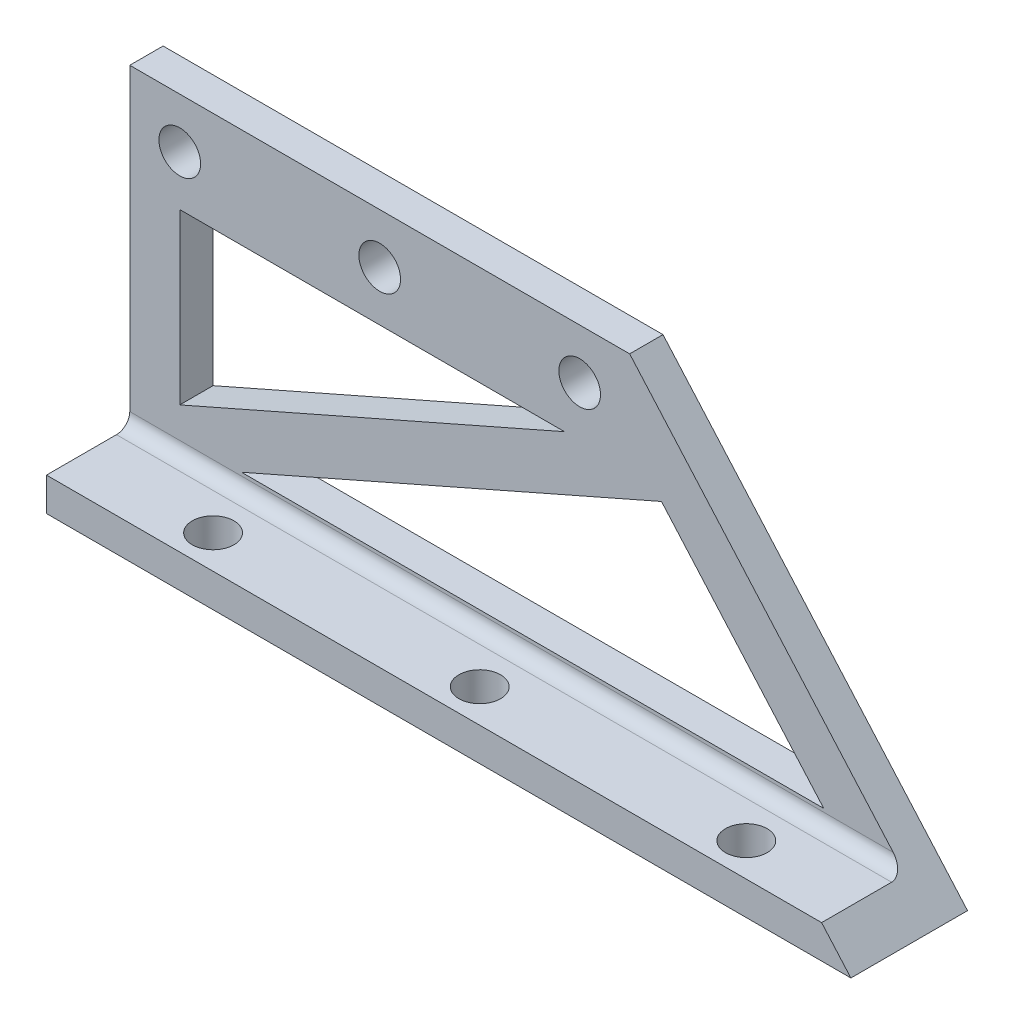
ISO-10303-21;
HEADER;
FILE_DESCRIPTION(('STEP AP214'),'2;1');
FILE_NAME('part.step','',(''),(''),'','','');
FILE_SCHEMA(('AUTOMOTIVE_DESIGN { 1 0 10303 214 1 1 1 1 }'));
ENDSEC;
DATA;
#1=APPLICATION_CONTEXT('core data for automotive mechanical design processes');
#2=APPLICATION_PROTOCOL_DEFINITION('international standard','automotive_design',2000,#1);
#3=PRODUCT_CONTEXT('',#1,'mechanical');
#4=PRODUCT('Part','Part','',(#3));
#5=PRODUCT_RELATED_PRODUCT_CATEGORY('part','',(#4));
#6=PRODUCT_DEFINITION_FORMATION('','',#4);
#7=PRODUCT_DEFINITION_CONTEXT('part definition',#1,'design');
#8=PRODUCT_DEFINITION('design','',#6,#7);
#9=PRODUCT_DEFINITION_SHAPE('','',#8);
#10=(LENGTH_UNIT() NAMED_UNIT(*) SI_UNIT(.MILLI.,.METRE.));
#11=(NAMED_UNIT(*) PLANE_ANGLE_UNIT() SI_UNIT($,.RADIAN.));
#12=(NAMED_UNIT(*) SI_UNIT($,.STERADIAN.) SOLID_ANGLE_UNIT());
#13=UNCERTAINTY_MEASURE_WITH_UNIT(LENGTH_MEASURE(1.E-05),#10,'distance_accuracy_value','');
#14=(GEOMETRIC_REPRESENTATION_CONTEXT(3) GLOBAL_UNCERTAINTY_ASSIGNED_CONTEXT((#13)) GLOBAL_UNIT_ASSIGNED_CONTEXT((#10,
#11,#12)) REPRESENTATION_CONTEXT('',''));
#15=CARTESIAN_POINT('',(0.,0.,0.));
#16=DIRECTION('',(0.,0.,1.));
#17=DIRECTION('',(1.,0.,0.));
#18=AXIS2_PLACEMENT_3D('',#15,#16,#17);
#19=CARTESIAN_POINT('',(0.,0.,6.35));
#20=DIRECTION('',(0.,0.,-1.));
#21=DIRECTION('',(-1.,0.,0.));
#22=AXIS2_PLACEMENT_3D('',#19,#20,#21);
#23=PLANE('',#22);
#24=DIRECTION('',(0.91541039740455,0.402521806022535,0.));
#25=VECTOR('',#24,1.);
#26=CARTESIAN_POINT('',(82.8299693463469,46.99,6.35));
#27=LINE('',#26,#25);
#28=CARTESIAN_POINT('',(9.52500000000001,14.7565353863377,6.35));
#29=VERTEX_POINT('',#28);
#30=CARTESIAN_POINT('',(82.8299693463469,46.99,6.35));
#31=VERTEX_POINT('',#30);
#32=EDGE_CURVE('E188',#29,#31,#27,.T.);
#33=ORIENTED_EDGE('',*,*,#32,.F.);
#34=DIRECTION('',(0.,-1.,0.));
#35=VECTOR('',#34,1.);
#36=CARTESIAN_POINT('',(9.52500000000001,14.7565353863377,6.35));
#37=LINE('',#36,#35);
#38=CARTESIAN_POINT('',(9.525,46.99,6.35));
#39=VERTEX_POINT('',#38);
#40=EDGE_CURVE('E194',#39,#29,#37,.T.);
#41=ORIENTED_EDGE('',*,*,#40,.F.);
#42=DIRECTION('',(-1.,0.,0.));
#43=VECTOR('',#42,1.);
#44=CARTESIAN_POINT('',(9.525,46.99,6.35));
#45=LINE('',#44,#43);
#46=EDGE_CURVE('E190',#31,#39,#45,.T.);
#47=ORIENTED_EDGE('',*,*,#46,.F.);
#48=EDGE_LOOP('',(#33,#41,#47));
#49=FACE_BOUND('',#48,.T.);
#50=CARTESIAN_POINT('',(47.625,56.515,6.35));
#51=DIRECTION('',(0.,0.,1.));
#52=DIRECTION('',(1.,0.,0.));
#53=AXIS2_PLACEMENT_3D('',#50,#51,#52);
#54=CIRCLE('',#53,3.96875);
#55=CARTESIAN_POINT('',(51.59375,56.515,6.35));
#56=VERTEX_POINT('',#55);
#57=EDGE_CURVE('E218',#56,#56,#54,.T.);
#58=ORIENTED_EDGE('',*,*,#57,.F.);
#59=EDGE_LOOP('',(#58));
#60=FACE_BOUND('',#59,.T.);
#61=DIRECTION('',(0.,-1.,0.));
#62=VECTOR('',#61,1.);
#63=CARTESIAN_POINT('',(0.,0.,6.35));
#64=LINE('',#63,#62);
#65=CARTESIAN_POINT('',(0.,66.04,6.35));
#66=VERTEX_POINT('',#65);
#67=CARTESIAN_POINT('',(0.,8.89,6.35));
#68=VERTEX_POINT('',#67);
#69=EDGE_CURVE('E234',#66,#68,#64,.T.);
#70=ORIENTED_EDGE('',*,*,#69,.T.);
#71=DIRECTION('',(1.,0.,0.));
#72=VECTOR('',#71,1.);
#73=CARTESIAN_POINT('',(0.,8.89,6.35));
#74=LINE('',#73,#72);
#75=CARTESIAN_POINT('',(145.465778034099,8.89000000000003,6.35));
#76=VERTEX_POINT('',#75);
#77=EDGE_CURVE('E138',#68,#76,#74,.T.);
#78=ORIENTED_EDGE('',*,*,#77,.T.);
#79=DIRECTION('',(-0.660063065152084,0.751210190307637,0.));
#80=VECTOR('',#79,1.);
#81=CARTESIAN_POINT('',(95.25,66.04,6.35));
#82=LINE('',#81,#80);
#83=CARTESIAN_POINT('',(95.25,66.04,6.35));
#84=VERTEX_POINT('',#83);
#85=EDGE_CURVE('E229',#76,#84,#82,.T.);
#86=ORIENTED_EDGE('',*,*,#85,.T.);
#87=DIRECTION('',(-1.,0.,0.));
#88=VECTOR('',#87,1.);
#89=CARTESIAN_POINT('',(0.,66.04,6.35));
#90=LINE('',#89,#88);
#91=EDGE_CURVE('E231',#84,#66,#90,.T.);
#92=ORIENTED_EDGE('',*,*,#91,.T.);
#93=EDGE_LOOP('',(#70,#78,#86,#92));
#94=FACE_BOUND('',#93,.T.);
#95=CARTESIAN_POINT('',(9.52500000000001,56.515,6.35));
#96=DIRECTION('',(0.,0.,1.));
#97=DIRECTION('',(1.,0.,0.));
#98=AXIS2_PLACEMENT_3D('',#95,#96,#97);
#99=CIRCLE('',#98,3.96875000000001);
#100=CARTESIAN_POINT('',(13.49375,56.515,6.35));
#101=VERTEX_POINT('',#100);
#102=EDGE_CURVE('E224',#101,#101,#99,.T.);
#103=ORIENTED_EDGE('',*,*,#102,.F.);
#104=EDGE_LOOP('',(#103));
#105=FACE_BOUND('',#104,.T.);
#106=CARTESIAN_POINT('',(85.725,56.515,6.35));
#107=DIRECTION('',(0.,0.,1.));
#108=DIRECTION('',(1.,0.,0.));
#109=AXIS2_PLACEMENT_3D('',#106,#107,#108);
#110=CIRCLE('',#109,3.96875000000001);
#111=CARTESIAN_POINT('',(89.69375,56.515,6.35));
#112=VERTEX_POINT('',#111);
#113=EDGE_CURVE('E212',#112,#112,#110,.T.);
#114=ORIENTED_EDGE('',*,*,#113,.F.);
#115=EDGE_LOOP('',(#114));
#116=FACE_BOUND('',#115,.T.);
#117=DIRECTION('',(1.,0.,0.));
#118=VECTOR('',#117,1.);
#119=CARTESIAN_POINT('',(132.228284487454,9.525,6.35));
#120=LINE('',#119,#118);
#121=CARTESIAN_POINT('',(21.2908175087575,9.52499999999998,6.35));
#122=VERTEX_POINT('',#121);
#123=CARTESIAN_POINT('',(132.228284487454,9.525,6.35));
#124=VERTEX_POINT('',#123);
#125=EDGE_CURVE('E164',#122,#124,#120,.T.);
#126=ORIENTED_EDGE('',*,*,#125,.F.);
#127=DIRECTION('',(-0.91541039740455,-0.402521806022535,0.));
#128=VECTOR('',#127,1.);
#129=CARTESIAN_POINT('',(21.2908175087575,9.52499999999998,6.35));
#130=LINE('',#129,#128);
#131=CARTESIAN_POINT('',(101.311219354226,44.7113565902367,6.35));
#132=VERTEX_POINT('',#131);
#133=EDGE_CURVE('E170',#132,#122,#130,.T.);
#134=ORIENTED_EDGE('',*,*,#133,.F.);
#135=DIRECTION('',(-0.660063065152084,0.751210190307637,0.));
#136=VECTOR('',#135,1.);
#137=CARTESIAN_POINT('',(101.311219354226,44.7113565902367,6.35));
#138=LINE('',#137,#136);
#139=EDGE_CURVE('E166',#124,#132,#138,.T.);
#140=ORIENTED_EDGE('',*,*,#139,.F.);
#141=EDGE_LOOP('',(#126,#134,#140));
#142=FACE_BOUND('',#141,.T.);
#143=ADVANCED_FACE('F33',(#49,#60,#94,#105,#116,#142),#23,.F.);
#144=CARTESIAN_POINT('',(0.,0.,0.));
#145=DIRECTION('',(0.,0.,-1.));
#146=DIRECTION('',(-1.,0.,0.));
#147=AXIS2_PLACEMENT_3D('',#144,#145,#146);
#148=PLANE('',#147);
#149=DIRECTION('',(0.,-1.,0.));
#150=VECTOR('',#149,1.);
#151=CARTESIAN_POINT('',(9.52500000000001,14.7565353863377,0.));
#152=LINE('',#151,#150);
#153=CARTESIAN_POINT('',(9.525,46.99,0.));
#154=VERTEX_POINT('',#153);
#155=CARTESIAN_POINT('',(9.52500000000001,14.7565353863377,0.));
#156=VERTEX_POINT('',#155);
#157=EDGE_CURVE('E191',#154,#156,#152,.T.);
#158=ORIENTED_EDGE('',*,*,#157,.T.);
#159=DIRECTION('',(0.91541039740455,0.402521806022535,0.));
#160=VECTOR('',#159,1.);
#161=CARTESIAN_POINT('',(82.8299693463469,46.99,0.));
#162=LINE('',#161,#160);
#163=CARTESIAN_POINT('',(82.8299693463469,46.99,0.));
#164=VERTEX_POINT('',#163);
#165=EDGE_CURVE('E187',#156,#164,#162,.T.);
#166=ORIENTED_EDGE('',*,*,#165,.T.);
#167=DIRECTION('',(-1.,0.,0.));
#168=VECTOR('',#167,1.);
#169=CARTESIAN_POINT('',(9.525,46.99,0.));
#170=LINE('',#169,#168);
#171=EDGE_CURVE('E199',#164,#154,#170,.T.);
#172=ORIENTED_EDGE('',*,*,#171,.T.);
#173=EDGE_LOOP('',(#158,#166,#172));
#174=FACE_BOUND('',#173,.T.);
#175=CARTESIAN_POINT('',(47.625,56.515,0.));
#176=DIRECTION('',(0.,0.,1.));
#177=DIRECTION('',(1.,0.,0.));
#178=AXIS2_PLACEMENT_3D('',#175,#176,#177);
#179=CIRCLE('',#178,3.96875);
#180=CARTESIAN_POINT('',(51.59375,56.515,0.));
#181=VERTEX_POINT('',#180);
#182=EDGE_CURVE('E215',#181,#181,#179,.T.);
#183=ORIENTED_EDGE('',*,*,#182,.T.);
#184=EDGE_LOOP('',(#183));
#185=FACE_BOUND('',#184,.T.);
#186=DIRECTION('',(1.,0.,0.));
#187=VECTOR('',#186,1.);
#188=CARTESIAN_POINT('',(153.277121283848,0.,0.));
#189=LINE('',#188,#187);
#190=CARTESIAN_POINT('',(0.,0.,0.));
#191=VERTEX_POINT('',#190);
#192=CARTESIAN_POINT('',(153.277121283848,0.,0.));
#193=VERTEX_POINT('',#192);
#194=EDGE_CURVE('E136',#191,#193,#189,.T.);
#195=ORIENTED_EDGE('',*,*,#194,.F.);
#196=DIRECTION('',(0.,-1.,0.));
#197=VECTOR('',#196,1.);
#198=CARTESIAN_POINT('',(0.,0.,0.));
#199=LINE('',#198,#197);
#200=CARTESIAN_POINT('',(0.,66.04,0.));
#201=VERTEX_POINT('',#200);
#202=EDGE_CURVE('E232',#201,#191,#199,.T.);
#203=ORIENTED_EDGE('',*,*,#202,.F.);
#204=DIRECTION('',(-1.,0.,0.));
#205=VECTOR('',#204,1.);
#206=CARTESIAN_POINT('',(0.,66.04,0.));
#207=LINE('',#206,#205);
#208=CARTESIAN_POINT('',(95.25,66.04,0.));
#209=VERTEX_POINT('',#208);
#210=EDGE_CURVE('E264',#209,#201,#207,.T.);
#211=ORIENTED_EDGE('',*,*,#210,.F.);
#212=DIRECTION('',(-0.660063065152084,0.751210190307637,0.));
#213=VECTOR('',#212,1.);
#214=CARTESIAN_POINT('',(95.25,66.04,0.));
#215=LINE('',#214,#213);
#216=EDGE_CURVE('E270',#193,#209,#215,.T.);
#217=ORIENTED_EDGE('',*,*,#216,.F.);
#218=EDGE_LOOP('',(#195,#203,#211,#217));
#219=FACE_BOUND('',#218,.T.);
#220=CARTESIAN_POINT('',(9.52500000000001,56.515,0.));
#221=DIRECTION('',(0.,0.,1.));
#222=DIRECTION('',(1.,0.,0.));
#223=AXIS2_PLACEMENT_3D('',#220,#221,#222);
#224=CIRCLE('',#223,3.96875000000001);
#225=CARTESIAN_POINT('',(13.49375,56.515,0.));
#226=VERTEX_POINT('',#225);
#227=EDGE_CURVE('E221',#226,#226,#224,.T.);
#228=ORIENTED_EDGE('',*,*,#227,.T.);
#229=EDGE_LOOP('',(#228));
#230=FACE_BOUND('',#229,.T.);
#231=CARTESIAN_POINT('',(85.725,56.515,0.));
#232=DIRECTION('',(0.,0.,1.));
#233=DIRECTION('',(1.,0.,0.));
#234=AXIS2_PLACEMENT_3D('',#231,#232,#233);
#235=CIRCLE('',#234,3.96875000000001);
#236=CARTESIAN_POINT('',(89.69375,56.515,0.));
#237=VERTEX_POINT('',#236);
#238=EDGE_CURVE('E211',#237,#237,#235,.T.);
#239=ORIENTED_EDGE('',*,*,#238,.T.);
#240=EDGE_LOOP('',(#239));
#241=FACE_BOUND('',#240,.T.);
#242=DIRECTION('',(-0.91541039740455,-0.402521806022535,0.));
#243=VECTOR('',#242,1.);
#244=CARTESIAN_POINT('',(21.2908175087575,9.52499999999998,0.));
#245=LINE('',#244,#243);
#246=CARTESIAN_POINT('',(101.311219354226,44.7113565902367,0.));
#247=VERTEX_POINT('',#246);
#248=CARTESIAN_POINT('',(21.2908175087575,9.52499999999998,0.));
#249=VERTEX_POINT('',#248);
#250=EDGE_CURVE('E167',#247,#249,#245,.T.);
#251=ORIENTED_EDGE('',*,*,#250,.T.);
#252=DIRECTION('',(1.,0.,0.));
#253=VECTOR('',#252,1.);
#254=CARTESIAN_POINT('',(132.228284487454,9.525,0.));
#255=LINE('',#254,#253);
#256=CARTESIAN_POINT('',(132.228284487454,9.525,0.));
#257=VERTEX_POINT('',#256);
#258=EDGE_CURVE('E163',#249,#257,#255,.T.);
#259=ORIENTED_EDGE('',*,*,#258,.T.);
#260=DIRECTION('',(-0.660063065152084,0.751210190307637,0.));
#261=VECTOR('',#260,1.);
#262=CARTESIAN_POINT('',(101.311219354226,44.7113565902367,0.));
#263=LINE('',#262,#261);
#264=EDGE_CURVE('E175',#257,#247,#263,.T.);
#265=ORIENTED_EDGE('',*,*,#264,.T.);
#266=EDGE_LOOP('',(#251,#259,#265));
#267=FACE_BOUND('',#266,.T.);
#268=ADVANCED_FACE('F272',(#174,#185,#219,#230,#241,#267),#148,.T.);
#269=CARTESIAN_POINT('',(153.277121283848,0.,6.35));
#270=DIRECTION('',(0.,1.,0.));
#271=DIRECTION('',(-1.,0.,0.));
#272=AXIS2_PLACEMENT_3D('',#269,#270,#271);
#273=PLANE('',#272);
#274=ORIENTED_EDGE('',*,*,#194,.T.);
#275=DIRECTION('',(0.,0.,-1.));
#276=VECTOR('',#275,1.);
#277=CARTESIAN_POINT('',(153.277121283848,0.,6.35));
#278=LINE('',#277,#276);
#279=CARTESIAN_POINT('',(153.277121283848,0.,22.225));
#280=VERTEX_POINT('',#279);
#281=EDGE_CURVE('E128',#280,#193,#278,.T.);
#282=ORIENTED_EDGE('',*,*,#281,.F.);
#283=DIRECTION('',(-1.,0.,0.));
#284=VECTOR('',#283,1.);
#285=CARTESIAN_POINT('',(0.,0.,22.225));
#286=LINE('',#285,#284);
#287=CARTESIAN_POINT('',(0.,0.,22.225));
#288=VERTEX_POINT('',#287);
#289=EDGE_CURVE('E134',#280,#288,#286,.T.);
#290=ORIENTED_EDGE('',*,*,#289,.T.);
#291=DIRECTION('',(0.,0.,-1.));
#292=VECTOR('',#291,1.);
#293=CARTESIAN_POINT('',(0.,0.,6.35));
#294=LINE('',#293,#292);
#295=EDGE_CURVE('E240',#288,#191,#294,.T.);
#296=ORIENTED_EDGE('',*,*,#295,.T.);
#297=EDGE_LOOP('',(#274,#282,#290,#296));
#298=FACE_BOUND('',#297,.T.);
#299=CARTESIAN_POINT('',(127.,0.,15.875));
#300=DIRECTION('',(0.,-1.,0.));
#301=DIRECTION('',(0.,0.,-1.));
#302=AXIS2_PLACEMENT_3D('',#299,#300,#301);
#303=CIRCLE('',#302,3.96874999999999);
#304=CARTESIAN_POINT('',(127.,0.,11.90625));
#305=VERTEX_POINT('',#304);
#306=EDGE_CURVE('E301',#305,#305,#303,.T.);
#307=ORIENTED_EDGE('',*,*,#306,.F.);
#308=EDGE_LOOP('',(#307));
#309=FACE_BOUND('',#308,.T.);
#310=CARTESIAN_POINT('',(76.2,0.,15.875));
#311=DIRECTION('',(0.,-1.,0.));
#312=DIRECTION('',(0.,0.,-1.));
#313=AXIS2_PLACEMENT_3D('',#310,#311,#312);
#314=CIRCLE('',#313,3.96875000000001);
#315=CARTESIAN_POINT('',(76.2,0.,11.90625));
#316=VERTEX_POINT('',#315);
#317=EDGE_CURVE('E296',#316,#316,#314,.T.);
#318=ORIENTED_EDGE('',*,*,#317,.F.);
#319=EDGE_LOOP('',(#318));
#320=FACE_BOUND('',#319,.T.);
#321=CARTESIAN_POINT('',(25.4,0.,15.875));
#322=DIRECTION('',(0.,-1.,0.));
#323=DIRECTION('',(0.,0.,-1.));
#324=AXIS2_PLACEMENT_3D('',#321,#322,#323);
#325=CIRCLE('',#324,3.96875);
#326=CARTESIAN_POINT('',(25.4,0.,11.90625));
#327=VERTEX_POINT('',#326);
#328=EDGE_CURVE('E157',#327,#327,#325,.T.);
#329=ORIENTED_EDGE('',*,*,#328,.F.);
#330=EDGE_LOOP('',(#329));
#331=FACE_BOUND('',#330,.T.);
#332=ADVANCED_FACE('F130',(#298,#309,#320,#331),#273,.F.);
#333=CARTESIAN_POINT('',(95.25,66.04,6.35));
#334=DIRECTION('',(-0.751210190307637,-0.660063065152084,0.));
#335=DIRECTION('',(0.660063065152084,-0.751210190307637,0.));
#336=AXIS2_PLACEMENT_3D('',#333,#334,#335);
#337=PLANE('',#336);
#338=DIRECTION('',(0.,0.,-1.));
#339=VECTOR('',#338,1.);
#340=CARTESIAN_POINT('',(95.25,66.04,6.35));
#341=LINE('',#340,#339);
#342=EDGE_CURVE('E139',#84,#209,#341,.T.);
#343=ORIENTED_EDGE('',*,*,#342,.F.);
#344=ORIENTED_EDGE('',*,*,#85,.F.);
#345=CARTESIAN_POINT('',(145.465778034099,8.89,8.89));
#346=DIRECTION('',(-0.751210190307637,-0.660063065152084,0.));
#347=DIRECTION('',(0.660063065152084,-0.751210190307637,0.));
#348=AXIS2_PLACEMENT_3D('',#345,#346,#347);
#349=ELLIPSE('',#348,3.38121078863403,2.54);
#350=CARTESIAN_POINT('',(147.69759039117,6.35,8.89));
#351=VERTEX_POINT('',#350);
#352=EDGE_CURVE('E41',#76,#351,#349,.T.);
#353=ORIENTED_EDGE('',*,*,#352,.T.);
#354=DIRECTION('',(0.,0.,1.));
#355=VECTOR('',#354,1.);
#356=CARTESIAN_POINT('',(147.69759039117,6.35,0.));
#357=LINE('',#356,#355);
#358=CARTESIAN_POINT('',(147.69759039117,6.35,22.225));
#359=VERTEX_POINT('',#358);
#360=EDGE_CURVE('E48',#351,#359,#357,.T.);
#361=ORIENTED_EDGE('',*,*,#360,.T.);
#362=DIRECTION('',(-0.660063065152084,0.751210190307637,0.));
#363=VECTOR('',#362,1.);
#364=CARTESIAN_POINT('',(153.277121283848,0.,22.225));
#365=LINE('',#364,#363);
#366=EDGE_CURVE('E142',#280,#359,#365,.T.);
#367=ORIENTED_EDGE('',*,*,#366,.F.);
#368=ORIENTED_EDGE('',*,*,#281,.T.);
#369=ORIENTED_EDGE('',*,*,#216,.T.);
#370=EDGE_LOOP('',(#343,#344,#353,#361,#367,#368,#369));
#371=FACE_BOUND('',#370,.T.);
#372=ADVANCED_FACE('F144',(#371),#337,.F.);
#373=CARTESIAN_POINT('',(0.,66.04,6.35));
#374=DIRECTION('',(0.,-1.,0.));
#375=DIRECTION('',(0.,0.,-1.));
#376=AXIS2_PLACEMENT_3D('',#373,#374,#375);
#377=PLANE('',#376);
#378=ORIENTED_EDGE('',*,*,#210,.T.);
#379=DIRECTION('',(0.,0.,-1.));
#380=VECTOR('',#379,1.);
#381=CARTESIAN_POINT('',(0.,66.04,6.35));
#382=LINE('',#381,#380);
#383=EDGE_CURVE('E261',#66,#201,#382,.T.);
#384=ORIENTED_EDGE('',*,*,#383,.F.);
#385=ORIENTED_EDGE('',*,*,#91,.F.);
#386=ORIENTED_EDGE('',*,*,#342,.T.);
#387=EDGE_LOOP('',(#378,#384,#385,#386));
#388=FACE_BOUND('',#387,.T.);
#389=ADVANCED_FACE('F262',(#388),#377,.F.);
#390=CARTESIAN_POINT('',(0.,0.,6.35));
#391=DIRECTION('',(1.,0.,0.));
#392=DIRECTION('',(0.,0.,-1.));
#393=AXIS2_PLACEMENT_3D('',#390,#391,#392);
#394=PLANE('',#393);
#395=ORIENTED_EDGE('',*,*,#202,.T.);
#396=ORIENTED_EDGE('',*,*,#295,.F.);
#397=DIRECTION('',(0.,-1.,0.));
#398=VECTOR('',#397,1.);
#399=CARTESIAN_POINT('',(0.,6.35,22.225));
#400=LINE('',#399,#398);
#401=CARTESIAN_POINT('',(0.,6.35,22.225));
#402=VERTEX_POINT('',#401);
#403=EDGE_CURVE('E150',#402,#288,#400,.T.);
#404=ORIENTED_EDGE('',*,*,#403,.F.);
#405=DIRECTION('',(0.,0.,-1.));
#406=VECTOR('',#405,1.);
#407=CARTESIAN_POINT('',(0.,6.35,6.35));
#408=LINE('',#407,#406);
#409=CARTESIAN_POINT('',(0.,6.35,8.89));
#410=VERTEX_POINT('',#409);
#411=EDGE_CURVE('E151',#402,#410,#408,.T.);
#412=ORIENTED_EDGE('',*,*,#411,.T.);
#413=CARTESIAN_POINT('',(0.,8.89,8.89));
#414=DIRECTION('',(1.,0.,0.));
#415=DIRECTION('',(0.,0.,-1.));
#416=AXIS2_PLACEMENT_3D('',#413,#414,#415);
#417=CIRCLE('',#416,2.54);
#418=EDGE_CURVE('E11',#410,#68,#417,.T.);
#419=ORIENTED_EDGE('',*,*,#418,.T.);
#420=ORIENTED_EDGE('',*,*,#69,.F.);
#421=ORIENTED_EDGE('',*,*,#383,.T.);
#422=EDGE_LOOP('',(#395,#396,#404,#412,#419,#420,#421));
#423=FACE_BOUND('',#422,.T.);
#424=ADVANCED_FACE('F253',(#423),#394,.F.);
#425=CARTESIAN_POINT('',(9.52500000000001,56.515,6.35));
#426=DIRECTION('',(0.,0.,-1.));
#427=DIRECTION('',(-1.,0.,0.));
#428=AXIS2_PLACEMENT_3D('',#425,#426,#427);
#429=CYLINDRICAL_SURFACE('',#428,3.96875000000001);
#430=ORIENTED_EDGE('',*,*,#102,.T.);
#431=EDGE_LOOP('',(#430));
#432=FACE_BOUND('',#431,.T.);
#433=ORIENTED_EDGE('',*,*,#227,.F.);
#434=EDGE_LOOP('',(#433));
#435=FACE_BOUND('',#434,.T.);
#436=ADVANCED_FACE('F331',(#432,#435),#429,.F.);
#437=CARTESIAN_POINT('',(47.625,56.515,6.35));
#438=DIRECTION('',(0.,0.,-1.));
#439=DIRECTION('',(-1.,0.,0.));
#440=AXIS2_PLACEMENT_3D('',#437,#438,#439);
#441=CYLINDRICAL_SURFACE('',#440,3.96875);
#442=ORIENTED_EDGE('',*,*,#57,.T.);
#443=EDGE_LOOP('',(#442));
#444=FACE_BOUND('',#443,.T.);
#445=ORIENTED_EDGE('',*,*,#182,.F.);
#446=EDGE_LOOP('',(#445));
#447=FACE_BOUND('',#446,.T.);
#448=ADVANCED_FACE('F359',(#444,#447),#441,.F.);
#449=CARTESIAN_POINT('',(85.725,56.515,6.35));
#450=DIRECTION('',(0.,0.,-1.));
#451=DIRECTION('',(-1.,0.,0.));
#452=AXIS2_PLACEMENT_3D('',#449,#450,#451);
#453=CYLINDRICAL_SURFACE('',#452,3.96875000000001);
#454=ORIENTED_EDGE('',*,*,#113,.T.);
#455=EDGE_LOOP('',(#454));
#456=FACE_BOUND('',#455,.T.);
#457=ORIENTED_EDGE('',*,*,#238,.F.);
#458=EDGE_LOOP('',(#457));
#459=FACE_BOUND('',#458,.T.);
#460=ADVANCED_FACE('F366',(#456,#459),#453,.F.);
#461=CARTESIAN_POINT('',(82.8299693463469,46.99,6.35));
#462=DIRECTION('',(-0.402521806022535,0.91541039740455,0.));
#463=DIRECTION('',(-0.91541039740455,-0.402521806022535,0.));
#464=AXIS2_PLACEMENT_3D('',#461,#462,#463);
#465=PLANE('',#464);
#466=ORIENTED_EDGE('',*,*,#165,.F.);
#467=DIRECTION('',(0.,0.,-1.));
#468=VECTOR('',#467,1.);
#469=CARTESIAN_POINT('',(9.52500000000001,14.7565353863377,6.35));
#470=LINE('',#469,#468);
#471=EDGE_CURVE('E196',#29,#156,#470,.T.);
#472=ORIENTED_EDGE('',*,*,#471,.F.);
#473=ORIENTED_EDGE('',*,*,#32,.T.);
#474=DIRECTION('',(0.,0.,-1.));
#475=VECTOR('',#474,1.);
#476=CARTESIAN_POINT('',(82.8299693463469,46.99,6.35));
#477=LINE('',#476,#475);
#478=EDGE_CURVE('E208',#31,#164,#477,.T.);
#479=ORIENTED_EDGE('',*,*,#478,.T.);
#480=EDGE_LOOP('',(#466,#472,#473,#479));
#481=FACE_BOUND('',#480,.T.);
#482=ADVANCED_FACE('F373',(#481),#465,.T.);
#483=CARTESIAN_POINT('',(9.525,46.99,6.35));
#484=DIRECTION('',(0.,-1.,0.));
#485=DIRECTION('',(0.,0.,-1.));
#486=AXIS2_PLACEMENT_3D('',#483,#484,#485);
#487=PLANE('',#486);
#488=ORIENTED_EDGE('',*,*,#171,.F.);
#489=ORIENTED_EDGE('',*,*,#478,.F.);
#490=ORIENTED_EDGE('',*,*,#46,.T.);
#491=DIRECTION('',(0.,0.,-1.));
#492=VECTOR('',#491,1.);
#493=CARTESIAN_POINT('',(9.525,46.99,6.35));
#494=LINE('',#493,#492);
#495=EDGE_CURVE('E206',#39,#154,#494,.T.);
#496=ORIENTED_EDGE('',*,*,#495,.T.);
#497=EDGE_LOOP('',(#488,#489,#490,#496));
#498=FACE_BOUND('',#497,.T.);
#499=ADVANCED_FACE('F381',(#498),#487,.T.);
#500=CARTESIAN_POINT('',(9.52500000000001,14.7565353863377,6.35));
#501=DIRECTION('',(1.,0.,0.));
#502=DIRECTION('',(0.,1.,0.));
#503=AXIS2_PLACEMENT_3D('',#500,#501,#502);
#504=PLANE('',#503);
#505=ORIENTED_EDGE('',*,*,#157,.F.);
#506=ORIENTED_EDGE('',*,*,#495,.F.);
#507=ORIENTED_EDGE('',*,*,#40,.T.);
#508=ORIENTED_EDGE('',*,*,#471,.T.);
#509=EDGE_LOOP('',(#505,#506,#507,#508));
#510=FACE_BOUND('',#509,.T.);
#511=ADVANCED_FACE('F389',(#510),#504,.T.);
#512=CARTESIAN_POINT('',(132.228284487454,9.525,6.35));
#513=DIRECTION('',(0.,1.,0.));
#514=DIRECTION('',(-1.,0.,0.));
#515=AXIS2_PLACEMENT_3D('',#512,#513,#514);
#516=PLANE('',#515);
#517=ORIENTED_EDGE('',*,*,#258,.F.);
#518=DIRECTION('',(0.,0.,-1.));
#519=VECTOR('',#518,1.);
#520=CARTESIAN_POINT('',(21.2908175087575,9.52499999999998,6.35));
#521=LINE('',#520,#519);
#522=EDGE_CURVE('E172',#122,#249,#521,.T.);
#523=ORIENTED_EDGE('',*,*,#522,.F.);
#524=ORIENTED_EDGE('',*,*,#125,.T.);
#525=DIRECTION('',(0.,0.,-1.));
#526=VECTOR('',#525,1.);
#527=CARTESIAN_POINT('',(132.228284487454,9.525,6.35));
#528=LINE('',#527,#526);
#529=EDGE_CURVE('E184',#124,#257,#528,.T.);
#530=ORIENTED_EDGE('',*,*,#529,.T.);
#531=EDGE_LOOP('',(#517,#523,#524,#530));
#532=FACE_BOUND('',#531,.T.);
#533=ADVANCED_FACE('F397',(#532),#516,.T.);
#534=CARTESIAN_POINT('',(101.311219354226,44.7113565902367,6.35));
#535=DIRECTION('',(-0.751210190307637,-0.660063065152084,0.));
#536=DIRECTION('',(0.660063065152084,-0.751210190307637,0.));
#537=AXIS2_PLACEMENT_3D('',#534,#535,#536);
#538=PLANE('',#537);
#539=ORIENTED_EDGE('',*,*,#264,.F.);
#540=ORIENTED_EDGE('',*,*,#529,.F.);
#541=ORIENTED_EDGE('',*,*,#139,.T.);
#542=DIRECTION('',(0.,0.,-1.));
#543=VECTOR('',#542,1.);
#544=CARTESIAN_POINT('',(101.311219354226,44.7113565902367,6.35));
#545=LINE('',#544,#543);
#546=EDGE_CURVE('E182',#132,#247,#545,.T.);
#547=ORIENTED_EDGE('',*,*,#546,.T.);
#548=EDGE_LOOP('',(#539,#540,#541,#547));
#549=FACE_BOUND('',#548,.T.);
#550=ADVANCED_FACE('F405',(#549),#538,.T.);
#551=CARTESIAN_POINT('',(21.2908175087575,9.52499999999998,6.35));
#552=DIRECTION('',(0.402521806022535,-0.91541039740455,0.));
#553=DIRECTION('',(0.91541039740455,0.402521806022535,0.));
#554=AXIS2_PLACEMENT_3D('',#551,#552,#553);
#555=PLANE('',#554);
#556=ORIENTED_EDGE('',*,*,#250,.F.);
#557=ORIENTED_EDGE('',*,*,#546,.F.);
#558=ORIENTED_EDGE('',*,*,#133,.T.);
#559=ORIENTED_EDGE('',*,*,#522,.T.);
#560=EDGE_LOOP('',(#556,#557,#558,#559));
#561=FACE_BOUND('',#560,.T.);
#562=ADVANCED_FACE('F413',(#561),#555,.T.);
#563=CARTESIAN_POINT('',(0.,6.35,22.225));
#564=DIRECTION('',(0.,0.,1.));
#565=DIRECTION('',(1.,0.,0.));
#566=AXIS2_PLACEMENT_3D('',#563,#564,#565);
#567=PLANE('',#566);
#568=ORIENTED_EDGE('',*,*,#366,.T.);
#569=DIRECTION('',(-1.,0.,0.));
#570=VECTOR('',#569,1.);
#571=CARTESIAN_POINT('',(0.,6.35,22.225));
#572=LINE('',#571,#570);
#573=EDGE_CURVE('E154',#359,#402,#572,.T.);
#574=ORIENTED_EDGE('',*,*,#573,.T.);
#575=ORIENTED_EDGE('',*,*,#403,.T.);
#576=ORIENTED_EDGE('',*,*,#289,.F.);
#577=EDGE_LOOP('',(#568,#574,#575,#576));
#578=FACE_BOUND('',#577,.T.);
#579=ADVANCED_FACE('F148',(#578),#567,.T.);
#580=CARTESIAN_POINT('',(0.,6.35,0.));
#581=DIRECTION('',(0.,1.,0.));
#582=DIRECTION('',(0.,0.,1.));
#583=AXIS2_PLACEMENT_3D('',#580,#581,#582);
#584=PLANE('',#583);
#585=ORIENTED_EDGE('',*,*,#360,.F.);
#586=DIRECTION('',(1.,0.,0.));
#587=VECTOR('',#586,1.);
#588=CARTESIAN_POINT('',(0.,6.35,8.89));
#589=LINE('',#588,#587);
#590=EDGE_CURVE('E53',#351,#410,#589,.F.);
#591=ORIENTED_EDGE('',*,*,#590,.T.);
#592=ORIENTED_EDGE('',*,*,#411,.F.);
#593=ORIENTED_EDGE('',*,*,#573,.F.);
#594=EDGE_LOOP('',(#585,#591,#592,#593));
#595=FACE_BOUND('',#594,.T.);
#596=CARTESIAN_POINT('',(127.,6.35,15.875));
#597=DIRECTION('',(0.,-1.,0.));
#598=DIRECTION('',(0.,0.,-1.));
#599=AXIS2_PLACEMENT_3D('',#596,#597,#598);
#600=CIRCLE('',#599,3.96874999999999);
#601=CARTESIAN_POINT('',(127.,6.35,11.90625));
#602=VERTEX_POINT('',#601);
#603=EDGE_CURVE('E282',#602,#602,#600,.T.);
#604=ORIENTED_EDGE('',*,*,#603,.T.);
#605=EDGE_LOOP('',(#604));
#606=FACE_BOUND('',#605,.T.);
#607=CARTESIAN_POINT('',(76.2,6.35,15.875));
#608=DIRECTION('',(0.,-1.,0.));
#609=DIRECTION('',(0.,0.,-1.));
#610=AXIS2_PLACEMENT_3D('',#607,#608,#609);
#611=CIRCLE('',#610,3.96875000000001);
#612=CARTESIAN_POINT('',(76.2,6.35,11.90625));
#613=VERTEX_POINT('',#612);
#614=EDGE_CURVE('E286',#613,#613,#611,.T.);
#615=ORIENTED_EDGE('',*,*,#614,.T.);
#616=EDGE_LOOP('',(#615));
#617=FACE_BOUND('',#616,.T.);
#618=CARTESIAN_POINT('',(25.4,6.35,15.875));
#619=DIRECTION('',(0.,-1.,0.));
#620=DIRECTION('',(0.,0.,-1.));
#621=AXIS2_PLACEMENT_3D('',#618,#619,#620);
#622=CIRCLE('',#621,3.96875);
#623=CARTESIAN_POINT('',(25.4,6.35,11.90625));
#624=VERTEX_POINT('',#623);
#625=EDGE_CURVE('E152',#624,#624,#622,.T.);
#626=ORIENTED_EDGE('',*,*,#625,.T.);
#627=EDGE_LOOP('',(#626));
#628=FACE_BOUND('',#627,.T.);
#629=ADVANCED_FACE('F274',(#595,#606,#617,#628),#584,.T.);
#630=CARTESIAN_POINT('',(25.4,6.35,15.875));
#631=DIRECTION('',(0.,-1.,0.));
#632=DIRECTION('',(0.,0.,-1.));
#633=AXIS2_PLACEMENT_3D('',#630,#631,#632);
#634=CYLINDRICAL_SURFACE('',#633,3.96875);
#635=ORIENTED_EDGE('',*,*,#625,.F.);
#636=EDGE_LOOP('',(#635));
#637=FACE_BOUND('',#636,.T.);
#638=ORIENTED_EDGE('',*,*,#328,.T.);
#639=EDGE_LOOP('',(#638));
#640=FACE_BOUND('',#639,.T.);
#641=ADVANCED_FACE('F277',(#637,#640),#634,.F.);
#642=CARTESIAN_POINT('',(76.2,6.35,15.875));
#643=DIRECTION('',(0.,-1.,0.));
#644=DIRECTION('',(0.,0.,-1.));
#645=AXIS2_PLACEMENT_3D('',#642,#643,#644);
#646=CYLINDRICAL_SURFACE('',#645,3.96875000000001);
#647=ORIENTED_EDGE('',*,*,#614,.F.);
#648=EDGE_LOOP('',(#647));
#649=FACE_BOUND('',#648,.T.);
#650=ORIENTED_EDGE('',*,*,#317,.T.);
#651=EDGE_LOOP('',(#650));
#652=FACE_BOUND('',#651,.T.);
#653=ADVANCED_FACE('F291',(#649,#652),#646,.F.);
#654=CARTESIAN_POINT('',(127.,6.35,15.875));
#655=DIRECTION('',(0.,-1.,0.));
#656=DIRECTION('',(0.,0.,-1.));
#657=AXIS2_PLACEMENT_3D('',#654,#655,#656);
#658=CYLINDRICAL_SURFACE('',#657,3.96874999999999);
#659=ORIENTED_EDGE('',*,*,#603,.F.);
#660=EDGE_LOOP('',(#659));
#661=FACE_BOUND('',#660,.T.);
#662=ORIENTED_EDGE('',*,*,#306,.T.);
#663=EDGE_LOOP('',(#662));
#664=FACE_BOUND('',#663,.T.);
#665=ADVANCED_FACE('F307',(#661,#664),#658,.F.);
#666=CARTESIAN_POINT('',(0.,8.89,8.89));
#667=DIRECTION('',(1.,0.,0.));
#668=DIRECTION('',(0.,0.,-1.));
#669=AXIS2_PLACEMENT_3D('',#666,#667,#668);
#670=CYLINDRICAL_SURFACE('',#669,2.54);
#671=ORIENTED_EDGE('',*,*,#418,.F.);
#672=ORIENTED_EDGE('',*,*,#590,.F.);
#673=ORIENTED_EDGE('',*,*,#352,.F.);
#674=ORIENTED_EDGE('',*,*,#77,.F.);
#675=EDGE_LOOP('',(#671,#672,#673,#674));
#676=FACE_BOUND('',#675,.T.);
#677=ADVANCED_FACE('F35',(#676),#670,.F.);
#678=CLOSED_SHELL('',(#143,#268,#332,#372,#389,#424,#436,#448,#460,#482,#499,#511,#533,#550,
#562,#579,#629,#641,#653,#665,#677));
#679=MANIFOLD_SOLID_BREP('B2',#678);
#680=ADVANCED_BREP_SHAPE_REPRESENTATION('',(#18,#679),#14);
#681=SHAPE_DEFINITION_REPRESENTATION(#9,#680);
ENDSEC;
END-ISO-10303-21;
